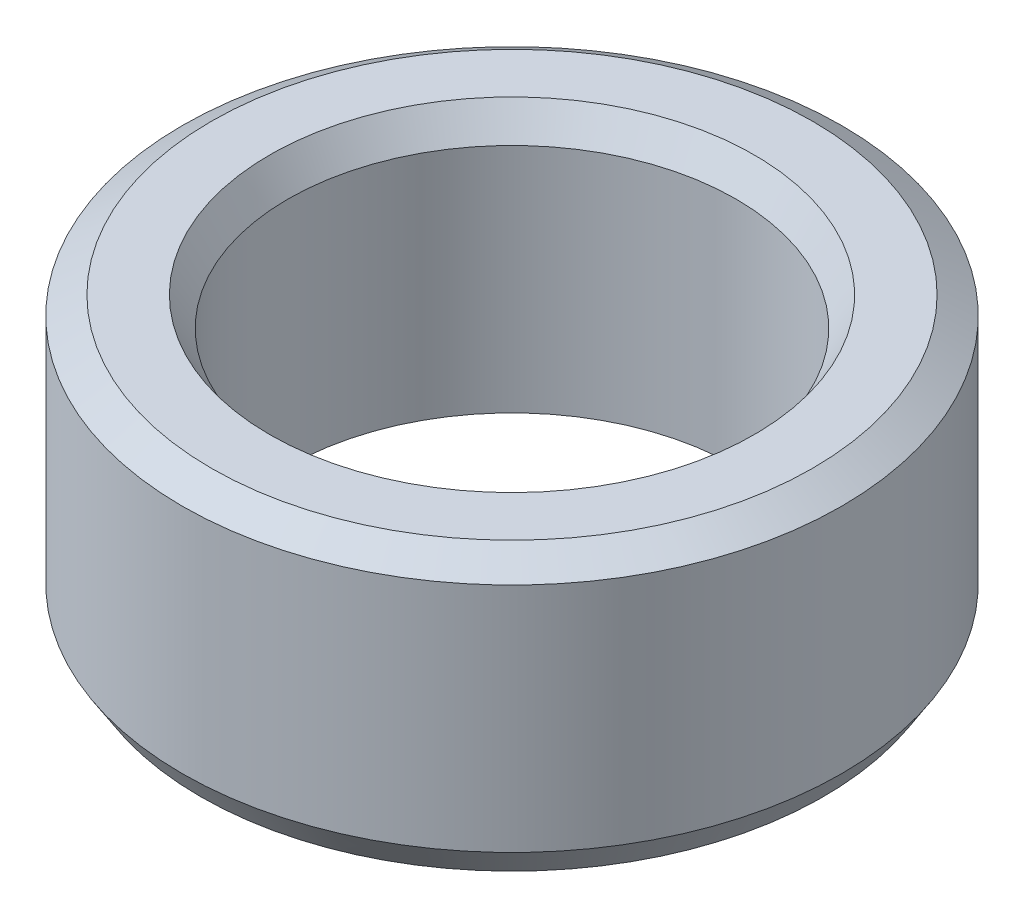
ISO-10303-21;
HEADER;
FILE_DESCRIPTION(('STEP AP214'),'2;1');
FILE_NAME('part.step','',(''),(''),'','','');
FILE_SCHEMA(('AUTOMOTIVE_DESIGN { 1 0 10303 214 1 1 1 1 }'));
ENDSEC;
DATA;
#1=APPLICATION_CONTEXT('core data for automotive mechanical design processes');
#2=APPLICATION_PROTOCOL_DEFINITION('international standard','automotive_design',2000,#1);
#3=PRODUCT_CONTEXT('',#1,'mechanical');
#4=PRODUCT('Part','Part','',(#3));
#5=PRODUCT_RELATED_PRODUCT_CATEGORY('part','',(#4));
#6=PRODUCT_DEFINITION_FORMATION('','',#4);
#7=PRODUCT_DEFINITION_CONTEXT('part definition',#1,'design');
#8=PRODUCT_DEFINITION('design','',#6,#7);
#9=PRODUCT_DEFINITION_SHAPE('','',#8);
#10=(LENGTH_UNIT() NAMED_UNIT(*) SI_UNIT(.MILLI.,.METRE.));
#11=(NAMED_UNIT(*) PLANE_ANGLE_UNIT() SI_UNIT($,.RADIAN.));
#12=(NAMED_UNIT(*) SI_UNIT($,.STERADIAN.) SOLID_ANGLE_UNIT());
#13=UNCERTAINTY_MEASURE_WITH_UNIT(LENGTH_MEASURE(1.E-05),#10,'distance_accuracy_value','');
#14=(GEOMETRIC_REPRESENTATION_CONTEXT(3) GLOBAL_UNCERTAINTY_ASSIGNED_CONTEXT((#13)) GLOBAL_UNIT_ASSIGNED_CONTEXT((#10,
#11,#12)) REPRESENTATION_CONTEXT('',''));
#15=CARTESIAN_POINT('',(0.,0.,0.));
#16=DIRECTION('',(0.,0.,1.));
#17=DIRECTION('',(1.,0.,0.));
#18=AXIS2_PLACEMENT_3D('',#15,#16,#17);
#19=CARTESIAN_POINT('',(0.,46.539392582031,0.));
#20=DIRECTION('',(0.,-1.,0.));
#21=DIRECTION('',(0.,0.,-1.));
#22=AXIS2_PLACEMENT_3D('',#19,#20,#21);
#23=CYLINDRICAL_SURFACE('',#22,55.);
#24=CARTESIAN_POINT('',(0.,4.85425917438224,0.));
#25=DIRECTION('',(0.,1.,0.));
#26=DIRECTION('',(0.,0.,1.));
#27=AXIS2_PLACEMENT_3D('',#24,#25,#26);
#28=CIRCLE('',#27,55.);
#29=CARTESIAN_POINT('',(0.,4.85425917438224,55.));
#30=VERTEX_POINT('',#29);
#31=EDGE_CURVE('E10',#30,#30,#28,.T.);
#32=ORIENTED_EDGE('',*,*,#31,.T.);
#33=EDGE_LOOP('',(#32));
#34=FACE_BOUND('',#33,.T.);
#35=CARTESIAN_POINT('',(0.,43.4923755247996,0.));
#36=DIRECTION('',(0.,1.,0.));
#37=DIRECTION('',(0.,0.,1.));
#38=AXIS2_PLACEMENT_3D('',#35,#36,#37);
#39=CIRCLE('',#38,55.);
#40=CARTESIAN_POINT('',(0.,43.4923755247996,55.));
#41=VERTEX_POINT('',#40);
#42=EDGE_CURVE('E50',#41,#41,#39,.F.);
#43=ORIENTED_EDGE('',*,*,#42,.T.);
#44=EDGE_LOOP('',(#43));
#45=FACE_BOUND('',#44,.T.);
#46=ADVANCED_FACE('F39',(#34,#45),#23,.T.);
#47=CARTESIAN_POINT('',(0.,46.539392582031,0.));
#48=DIRECTION('',(0.,1.,0.));
#49=DIRECTION('',(0.,0.,1.));
#50=AXIS2_PLACEMENT_3D('',#47,#48,#49);
#51=PLANE('',#50);
#52=CARTESIAN_POINT('',(0.,46.539392582031,0.));
#53=DIRECTION('',(0.,1.,0.));
#54=DIRECTION('',(0.,0.,1.));
#55=AXIS2_PLACEMENT_3D('',#52,#53,#54);
#56=CIRCLE('',#55,40.4187340139925);
#57=CARTESIAN_POINT('',(0.,46.539392582031,40.4187340139925));
#58=VERTEX_POINT('',#57);
#59=EDGE_CURVE('E58',#58,#58,#56,.F.);
#60=ORIENTED_EDGE('',*,*,#59,.T.);
#61=EDGE_LOOP('',(#60));
#62=FACE_BOUND('',#61,.T.);
#63=CARTESIAN_POINT('',(0.,46.539392582031,0.));
#64=DIRECTION('',(0.,1.,0.));
#65=DIRECTION('',(0.,0.,1.));
#66=AXIS2_PLACEMENT_3D('',#63,#64,#65);
#67=CIRCLE('',#66,50.1457408256178);
#68=CARTESIAN_POINT('',(0.,46.539392582031,50.1457408256178));
#69=VERTEX_POINT('',#68);
#70=EDGE_CURVE('E61',#69,#69,#67,.T.);
#71=ORIENTED_EDGE('',*,*,#70,.T.);
#72=EDGE_LOOP('',(#71));
#73=FACE_BOUND('',#72,.T.);
#74=ADVANCED_FACE('F88',(#62,#73),#51,.T.);
#75=CARTESIAN_POINT('',(0.,0.,0.));
#76=DIRECTION('',(0.,1.,0.));
#77=DIRECTION('',(0.,0.,1.));
#78=AXIS2_PLACEMENT_3D('',#75,#76,#77);
#79=PLANE('',#78);
#80=CARTESIAN_POINT('',(0.,0.,0.));
#81=DIRECTION('',(0.,1.,0.));
#82=DIRECTION('',(0.,0.,1.));
#83=AXIS2_PLACEMENT_3D('',#80,#81,#82);
#84=CIRCLE('',#83,42.2259761311432);
#85=CARTESIAN_POINT('',(0.,0.,42.2259761311432));
#86=VERTEX_POINT('',#85);
#87=EDGE_CURVE('E51',#86,#86,#84,.T.);
#88=ORIENTED_EDGE('',*,*,#87,.T.);
#89=EDGE_LOOP('',(#88));
#90=FACE_BOUND('',#89,.T.);
#91=CARTESIAN_POINT('',(0.,0.,0.));
#92=DIRECTION('',(0.,1.,0.));
#93=DIRECTION('',(0.,0.,1.));
#94=AXIS2_PLACEMENT_3D('',#91,#92,#93);
#95=CIRCLE('',#94,51.9529829427685);
#96=CARTESIAN_POINT('',(0.,0.,51.9529829427685));
#97=VERTEX_POINT('',#96);
#98=EDGE_CURVE('E54',#97,#97,#95,.F.);
#99=ORIENTED_EDGE('',*,*,#98,.T.);
#100=EDGE_LOOP('',(#99));
#101=FACE_BOUND('',#100,.T.);
#102=ADVANCED_FACE('F83',(#90,#101),#79,.F.);
#103=CARTESIAN_POINT('',(0.,46.539392582031,0.));
#104=DIRECTION('',(0.,-1.,0.));
#105=DIRECTION('',(0.,0.,-1.));
#106=AXIS2_PLACEMENT_3D('',#103,#104,#105);
#107=CYLINDRICAL_SURFACE('',#106,37.3717169567609);
#108=CARTESIAN_POINT('',(0.,41.6851334076488,0.));
#109=DIRECTION('',(0.,1.,0.));
#110=DIRECTION('',(0.,0.,1.));
#111=AXIS2_PLACEMENT_3D('',#108,#109,#110);
#112=CIRCLE('',#111,37.3717169567609);
#113=CARTESIAN_POINT('',(0.,41.6851334076488,37.3717169567609));
#114=VERTEX_POINT('',#113);
#115=EDGE_CURVE('E67',#114,#114,#112,.T.);
#116=ORIENTED_EDGE('',*,*,#115,.T.);
#117=EDGE_LOOP('',(#116));
#118=FACE_BOUND('',#117,.T.);
#119=CARTESIAN_POINT('',(0.,3.04701705723151,0.));
#120=DIRECTION('',(0.,1.,0.));
#121=DIRECTION('',(0.,0.,1.));
#122=AXIS2_PLACEMENT_3D('',#119,#120,#121);
#123=CIRCLE('',#122,37.3717169567609);
#124=CARTESIAN_POINT('',(0.,3.04701705723151,37.3717169567609));
#125=VERTEX_POINT('',#124);
#126=EDGE_CURVE('E69',#125,#125,#123,.F.);
#127=ORIENTED_EDGE('',*,*,#126,.T.);
#128=EDGE_LOOP('',(#127));
#129=FACE_BOUND('',#128,.T.);
#130=ADVANCED_FACE('F71',(#118,#129),#107,.F.);
#131=CARTESIAN_POINT('',(0.,41.6851334076488,0.));
#132=DIRECTION('',(0.,1.,0.));
#133=DIRECTION('',(0.,0.,1.));
#134=AXIS2_PLACEMENT_3D('',#131,#132,#133);
#135=CONICAL_SURFACE('',#134,37.3717169567609,0.560538321925256);
#136=ORIENTED_EDGE('',*,*,#59,.F.);
#137=EDGE_LOOP('',(#136));
#138=FACE_BOUND('',#137,.T.);
#139=ORIENTED_EDGE('',*,*,#115,.F.);
#140=EDGE_LOOP('',(#139));
#141=FACE_BOUND('',#140,.T.);
#142=ADVANCED_FACE('F77',(#138,#141),#135,.F.);
#143=CARTESIAN_POINT('',(0.,0.,0.));
#144=DIRECTION('',(0.,-1.,0.));
#145=DIRECTION('',(0.,0.,-1.));
#146=AXIS2_PLACEMENT_3D('',#143,#144,#145);
#147=CONICAL_SURFACE('',#146,42.2259761311432,1.01025800486964);
#148=ORIENTED_EDGE('',*,*,#126,.F.);
#149=EDGE_LOOP('',(#148));
#150=FACE_BOUND('',#149,.T.);
#151=ORIENTED_EDGE('',*,*,#87,.F.);
#152=EDGE_LOOP('',(#151));
#153=FACE_BOUND('',#152,.T.);
#154=ADVANCED_FACE('F73',(#150,#153),#147,.F.);
#155=CARTESIAN_POINT('',(0.,4.85425917438224,0.));
#156=DIRECTION('',(0.,1.,0.));
#157=DIRECTION('',(0.,0.,1.));
#158=AXIS2_PLACEMENT_3D('',#155,#156,#157);
#159=CONICAL_SURFACE('',#158,55.,0.560538321925252);
#160=ORIENTED_EDGE('',*,*,#98,.F.);
#161=EDGE_LOOP('',(#160));
#162=FACE_BOUND('',#161,.T.);
#163=ORIENTED_EDGE('',*,*,#31,.F.);
#164=EDGE_LOOP('',(#163));
#165=FACE_BOUND('',#164,.T.);
#166=ADVANCED_FACE('F76',(#162,#165),#159,.T.);
#167=CARTESIAN_POINT('',(0.,46.539392582031,0.));
#168=DIRECTION('',(0.,-1.,0.));
#169=DIRECTION('',(0.,0.,-1.));
#170=AXIS2_PLACEMENT_3D('',#167,#168,#169);
#171=CONICAL_SURFACE('',#170,50.1457408256178,1.01025800486964);
#172=ORIENTED_EDGE('',*,*,#42,.F.);
#173=EDGE_LOOP('',(#172));
#174=FACE_BOUND('',#173,.T.);
#175=ORIENTED_EDGE('',*,*,#70,.F.);
#176=EDGE_LOOP('',(#175));
#177=FACE_BOUND('',#176,.T.);
#178=ADVANCED_FACE('F45',(#174,#177),#171,.T.);
#179=CLOSED_SHELL('',(#46,#74,#102,#130,#142,#154,#166,#178));
#180=MANIFOLD_SOLID_BREP('B2',#179);
#181=ADVANCED_BREP_SHAPE_REPRESENTATION('',(#18,#180),#14);
#182=SHAPE_DEFINITION_REPRESENTATION(#9,#181);
ENDSEC;
END-ISO-10303-21;
